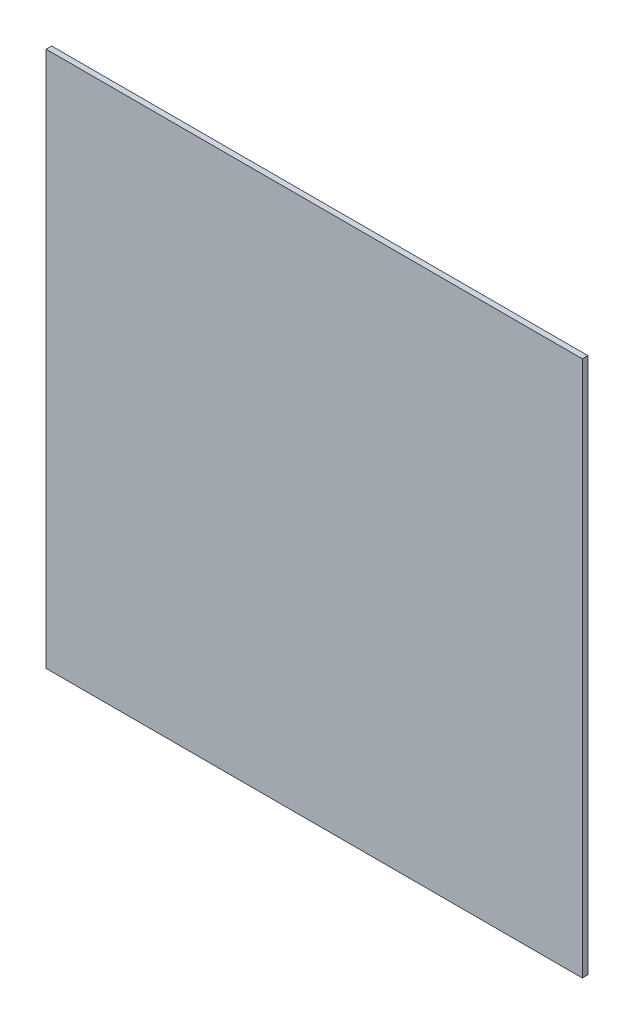
ISO-10303-21;
HEADER;
FILE_DESCRIPTION(('STEP AP214'),'2;1');
FILE_NAME('part.step','',(''),(''),'','','');
FILE_SCHEMA(('AUTOMOTIVE_DESIGN { 1 0 10303 214 1 1 1 1 }'));
ENDSEC;
DATA;
#1=APPLICATION_CONTEXT('core data for automotive mechanical design processes');
#2=APPLICATION_PROTOCOL_DEFINITION('international standard','automotive_design',2000,#1);
#3=PRODUCT_CONTEXT('',#1,'mechanical');
#4=PRODUCT('Part','Part','',(#3));
#5=PRODUCT_RELATED_PRODUCT_CATEGORY('part','',(#4));
#6=PRODUCT_DEFINITION_FORMATION('','',#4);
#7=PRODUCT_DEFINITION_CONTEXT('part definition',#1,'design');
#8=PRODUCT_DEFINITION('design','',#6,#7);
#9=PRODUCT_DEFINITION_SHAPE('','',#8);
#10=(LENGTH_UNIT() NAMED_UNIT(*) SI_UNIT(.MILLI.,.METRE.));
#11=(NAMED_UNIT(*) PLANE_ANGLE_UNIT() SI_UNIT($,.RADIAN.));
#12=(NAMED_UNIT(*) SI_UNIT($,.STERADIAN.) SOLID_ANGLE_UNIT());
#13=UNCERTAINTY_MEASURE_WITH_UNIT(LENGTH_MEASURE(1.E-05),#10,'distance_accuracy_value','');
#14=(GEOMETRIC_REPRESENTATION_CONTEXT(3) GLOBAL_UNCERTAINTY_ASSIGNED_CONTEXT((#13)) GLOBAL_UNIT_ASSIGNED_CONTEXT((#10,
#11,#12)) REPRESENTATION_CONTEXT('',''));
#15=CARTESIAN_POINT('',(0.,0.,0.));
#16=DIRECTION('',(0.,0.,1.));
#17=DIRECTION('',(1.,0.,0.));
#18=AXIS2_PLACEMENT_3D('',#15,#16,#17);
#19=CARTESIAN_POINT('',(152.4,-152.4,3.175));
#20=DIRECTION('',(-1.,0.,0.));
#21=DIRECTION('',(0.,0.,1.));
#22=AXIS2_PLACEMENT_3D('',#19,#20,#21);
#23=PLANE('',#22);
#24=DIRECTION('',(0.,1.,0.));
#25=VECTOR('',#24,1.);
#26=CARTESIAN_POINT('',(152.4,-152.4,0.));
#27=LINE('',#26,#25);
#28=CARTESIAN_POINT('',(152.4,-152.4,0.));
#29=VERTEX_POINT('',#28);
#30=CARTESIAN_POINT('',(152.4,152.4,0.));
#31=VERTEX_POINT('',#30);
#32=EDGE_CURVE('E96',#29,#31,#27,.T.);
#33=ORIENTED_EDGE('',*,*,#32,.T.);
#34=DIRECTION('',(0.,0.,-1.));
#35=VECTOR('',#34,1.);
#36=CARTESIAN_POINT('',(152.4,152.4,3.175));
#37=LINE('',#36,#35);
#38=CARTESIAN_POINT('',(152.4,152.4,3.175));
#39=VERTEX_POINT('',#38);
#40=EDGE_CURVE('E11',#39,#31,#37,.T.);
#41=ORIENTED_EDGE('',*,*,#40,.F.);
#42=DIRECTION('',(0.,1.,0.));
#43=VECTOR('',#42,1.);
#44=CARTESIAN_POINT('',(152.4,-152.4,3.175));
#45=LINE('',#44,#43);
#46=CARTESIAN_POINT('',(152.4,-152.4,3.175));
#47=VERTEX_POINT('',#46);
#48=EDGE_CURVE('E84',#47,#39,#45,.T.);
#49=ORIENTED_EDGE('',*,*,#48,.F.);
#50=DIRECTION('',(0.,0.,-1.));
#51=VECTOR('',#50,1.);
#52=CARTESIAN_POINT('',(152.4,-152.4,3.175));
#53=LINE('',#52,#51);
#54=EDGE_CURVE('E92',#47,#29,#53,.T.);
#55=ORIENTED_EDGE('',*,*,#54,.T.);
#56=EDGE_LOOP('',(#33,#41,#49,#55));
#57=FACE_BOUND('',#56,.T.);
#58=ADVANCED_FACE('F33',(#57),#23,.F.);
#59=CARTESIAN_POINT('',(-152.4,152.4,3.175));
#60=DIRECTION('',(0.,-1.,0.));
#61=DIRECTION('',(0.,0.,-1.));
#62=AXIS2_PLACEMENT_3D('',#59,#60,#61);
#63=PLANE('',#62);
#64=DIRECTION('',(-1.,0.,0.));
#65=VECTOR('',#64,1.);
#66=CARTESIAN_POINT('',(-152.4,152.4,0.));
#67=LINE('',#66,#65);
#68=CARTESIAN_POINT('',(-152.4,152.4,0.));
#69=VERTEX_POINT('',#68);
#70=EDGE_CURVE('E88',#31,#69,#67,.T.);
#71=ORIENTED_EDGE('',*,*,#70,.T.);
#72=DIRECTION('',(0.,0.,-1.));
#73=VECTOR('',#72,1.);
#74=CARTESIAN_POINT('',(-152.4,152.4,3.175));
#75=LINE('',#74,#73);
#76=CARTESIAN_POINT('',(-152.4,152.4,3.175));
#77=VERTEX_POINT('',#76);
#78=EDGE_CURVE('E41',#77,#69,#75,.T.);
#79=ORIENTED_EDGE('',*,*,#78,.F.);
#80=DIRECTION('',(-1.,0.,0.));
#81=VECTOR('',#80,1.);
#82=CARTESIAN_POINT('',(-152.4,152.4,3.175));
#83=LINE('',#82,#81);
#84=EDGE_CURVE('E79',#39,#77,#83,.T.);
#85=ORIENTED_EDGE('',*,*,#84,.F.);
#86=ORIENTED_EDGE('',*,*,#40,.T.);
#87=EDGE_LOOP('',(#71,#79,#85,#86));
#88=FACE_BOUND('',#87,.T.);
#89=ADVANCED_FACE('F87',(#88),#63,.F.);
#90=CARTESIAN_POINT('',(-152.4,-152.4,3.175));
#91=DIRECTION('',(1.,0.,0.));
#92=DIRECTION('',(0.,0.,-1.));
#93=AXIS2_PLACEMENT_3D('',#90,#91,#92);
#94=PLANE('',#93);
#95=DIRECTION('',(0.,-1.,0.));
#96=VECTOR('',#95,1.);
#97=CARTESIAN_POINT('',(-152.4,-152.4,0.));
#98=LINE('',#97,#96);
#99=CARTESIAN_POINT('',(-152.4,-152.4,0.));
#100=VERTEX_POINT('',#99);
#101=EDGE_CURVE('E66',#69,#100,#98,.T.);
#102=ORIENTED_EDGE('',*,*,#101,.T.);
#103=DIRECTION('',(0.,0.,-1.));
#104=VECTOR('',#103,1.);
#105=CARTESIAN_POINT('',(-152.4,-152.4,3.175));
#106=LINE('',#105,#104);
#107=CARTESIAN_POINT('',(-152.4,-152.4,3.175));
#108=VERTEX_POINT('',#107);
#109=EDGE_CURVE('E89',#108,#100,#106,.T.);
#110=ORIENTED_EDGE('',*,*,#109,.F.);
#111=DIRECTION('',(0.,-1.,0.));
#112=VECTOR('',#111,1.);
#113=CARTESIAN_POINT('',(-152.4,-152.4,3.175));
#114=LINE('',#113,#112);
#115=EDGE_CURVE('E82',#77,#108,#114,.T.);
#116=ORIENTED_EDGE('',*,*,#115,.F.);
#117=ORIENTED_EDGE('',*,*,#78,.T.);
#118=EDGE_LOOP('',(#102,#110,#116,#117));
#119=FACE_BOUND('',#118,.T.);
#120=ADVANCED_FACE('F90',(#119),#94,.F.);
#121=CARTESIAN_POINT('',(-152.4,-152.4,3.175));
#122=DIRECTION('',(0.,1.,0.));
#123=DIRECTION('',(0.,0.,1.));
#124=AXIS2_PLACEMENT_3D('',#121,#122,#123);
#125=PLANE('',#124);
#126=DIRECTION('',(1.,0.,0.));
#127=VECTOR('',#126,1.);
#128=CARTESIAN_POINT('',(-152.4,-152.4,0.));
#129=LINE('',#128,#127);
#130=EDGE_CURVE('E72',#100,#29,#129,.T.);
#131=ORIENTED_EDGE('',*,*,#130,.T.);
#132=ORIENTED_EDGE('',*,*,#54,.F.);
#133=DIRECTION('',(1.,0.,0.));
#134=VECTOR('',#133,1.);
#135=CARTESIAN_POINT('',(-152.4,-152.4,3.175));
#136=LINE('',#135,#134);
#137=EDGE_CURVE('E49',#108,#47,#136,.T.);
#138=ORIENTED_EDGE('',*,*,#137,.F.);
#139=ORIENTED_EDGE('',*,*,#109,.T.);
#140=EDGE_LOOP('',(#131,#132,#138,#139));
#141=FACE_BOUND('',#140,.T.);
#142=ADVANCED_FACE('F103',(#141),#125,.F.);
#143=CARTESIAN_POINT('',(0.,0.,3.175));
#144=DIRECTION('',(0.,0.,-1.));
#145=DIRECTION('',(-1.,0.,0.));
#146=AXIS2_PLACEMENT_3D('',#143,#144,#145);
#147=PLANE('',#146);
#148=ORIENTED_EDGE('',*,*,#48,.T.);
#149=ORIENTED_EDGE('',*,*,#84,.T.);
#150=ORIENTED_EDGE('',*,*,#115,.T.);
#151=ORIENTED_EDGE('',*,*,#137,.T.);
#152=EDGE_LOOP('',(#148,#149,#150,#151));
#153=FACE_BOUND('',#152,.T.);
#154=ADVANCED_FACE('F80',(#153),#147,.F.);
#155=CARTESIAN_POINT('',(0.,0.,0.));
#156=DIRECTION('',(0.,0.,-1.));
#157=DIRECTION('',(-1.,0.,0.));
#158=AXIS2_PLACEMENT_3D('',#155,#156,#157);
#159=PLANE('',#158);
#160=ORIENTED_EDGE('',*,*,#32,.F.);
#161=ORIENTED_EDGE('',*,*,#130,.F.);
#162=ORIENTED_EDGE('',*,*,#101,.F.);
#163=ORIENTED_EDGE('',*,*,#70,.F.);
#164=EDGE_LOOP('',(#160,#161,#162,#163));
#165=FACE_BOUND('',#164,.T.);
#166=ADVANCED_FACE('F106',(#165),#159,.T.);
#167=CLOSED_SHELL('',(#58,#89,#120,#142,#154,#166));
#168=MANIFOLD_SOLID_BREP('B2',#167);
#169=ADVANCED_BREP_SHAPE_REPRESENTATION('',(#18,#168),#14);
#170=SHAPE_DEFINITION_REPRESENTATION(#9,#169);
ENDSEC;
END-ISO-10303-21;
